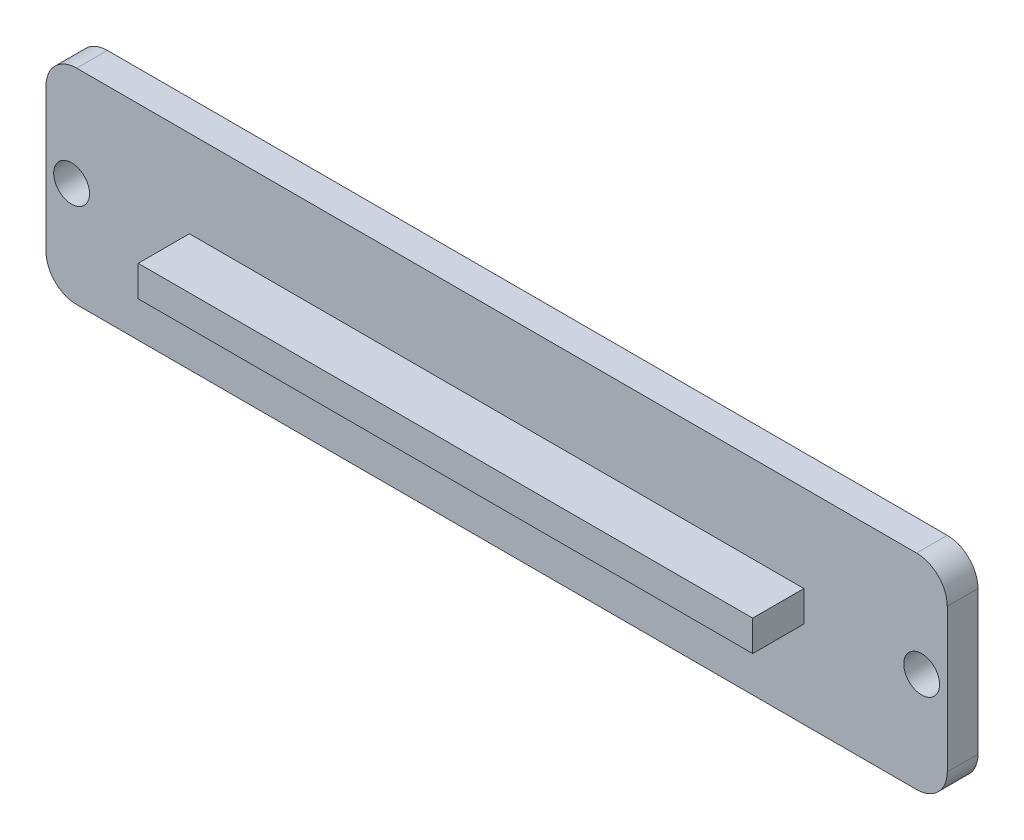
ISO-10303-21;
HEADER;
FILE_DESCRIPTION(('STEP AP214'),'2;1');
FILE_NAME('part.step','',(''),(''),'','','');
FILE_SCHEMA(('AUTOMOTIVE_DESIGN { 1 0 10303 214 1 1 1 1 }'));
ENDSEC;
DATA;
#1=APPLICATION_CONTEXT('core data for automotive mechanical design processes');
#2=APPLICATION_PROTOCOL_DEFINITION('international standard','automotive_design',2000,#1);
#3=PRODUCT_CONTEXT('',#1,'mechanical');
#4=PRODUCT('Part','Part','',(#3));
#5=PRODUCT_RELATED_PRODUCT_CATEGORY('part','',(#4));
#6=PRODUCT_DEFINITION_FORMATION('','',#4);
#7=PRODUCT_DEFINITION_CONTEXT('part definition',#1,'design');
#8=PRODUCT_DEFINITION('design','',#6,#7);
#9=PRODUCT_DEFINITION_SHAPE('','',#8);
#10=(LENGTH_UNIT() NAMED_UNIT(*) SI_UNIT(.MILLI.,.METRE.));
#11=(NAMED_UNIT(*) PLANE_ANGLE_UNIT() SI_UNIT($,.RADIAN.));
#12=(NAMED_UNIT(*) SI_UNIT($,.STERADIAN.) SOLID_ANGLE_UNIT());
#13=UNCERTAINTY_MEASURE_WITH_UNIT(LENGTH_MEASURE(1.E-05),#10,'distance_accuracy_value','');
#14=(GEOMETRIC_REPRESENTATION_CONTEXT(3) GLOBAL_UNCERTAINTY_ASSIGNED_CONTEXT((#13)) GLOBAL_UNIT_ASSIGNED_CONTEXT((#10,
#11,#12)) REPRESENTATION_CONTEXT('',''));
#15=CARTESIAN_POINT('',(0.,0.,0.));
#16=DIRECTION('',(0.,0.,1.));
#17=DIRECTION('',(1.,0.,0.));
#18=AXIS2_PLACEMENT_3D('',#15,#16,#17);
#19=CARTESIAN_POINT('',(0.,0.,3.));
#20=DIRECTION('',(0.,0.,-1.));
#21=DIRECTION('',(-1.,0.,0.));
#22=AXIS2_PLACEMENT_3D('',#19,#20,#21);
#23=PLANE('',#22);
#24=CARTESIAN_POINT('',(85.5,10.,3.));
#25=DIRECTION('',(0.,0.,1.));
#26=DIRECTION('',(1.,0.,0.));
#27=AXIS2_PLACEMENT_3D('',#24,#25,#26);
#28=CIRCLE('',#27,1.75);
#29=CARTESIAN_POINT('',(87.25,10.,3.));
#30=VERTEX_POINT('',#29);
#31=EDGE_CURVE('E152',#30,#30,#28,.T.);
#32=ORIENTED_EDGE('',*,*,#31,.F.);
#33=EDGE_LOOP('',(#32));
#34=FACE_BOUND('',#33,.T.);
#35=CARTESIAN_POINT('',(2.5,10.,3.));
#36=DIRECTION('',(0.,0.,1.));
#37=DIRECTION('',(1.,0.,0.));
#38=AXIS2_PLACEMENT_3D('',#35,#36,#37);
#39=CIRCLE('',#38,1.75);
#40=CARTESIAN_POINT('',(4.24999999999999,10.,3.));
#41=VERTEX_POINT('',#40);
#42=EDGE_CURVE('E161',#41,#41,#39,.T.);
#43=ORIENTED_EDGE('',*,*,#42,.F.);
#44=EDGE_LOOP('',(#43));
#45=FACE_BOUND('',#44,.T.);
#46=DIRECTION('',(1.,0.,0.));
#47=VECTOR('',#46,1.);
#48=CARTESIAN_POINT('',(0.,0.,3.));
#49=LINE('',#48,#47);
#50=CARTESIAN_POINT('',(3.,0.,3.));
#51=VERTEX_POINT('',#50);
#52=CARTESIAN_POINT('',(85.,0.,3.));
#53=VERTEX_POINT('',#52);
#54=EDGE_CURVE('E170',#51,#53,#49,.T.);
#55=ORIENTED_EDGE('',*,*,#54,.T.);
#56=CARTESIAN_POINT('',(85.,3.,3.));
#57=DIRECTION('',(0.,0.,-1.));
#58=DIRECTION('',(-1.,0.,0.));
#59=AXIS2_PLACEMENT_3D('',#56,#57,#58);
#60=CIRCLE('',#59,3.);
#61=CARTESIAN_POINT('',(88.,3.,3.));
#62=VERTEX_POINT('',#61);
#63=EDGE_CURVE('E210',#53,#62,#60,.F.);
#64=ORIENTED_EDGE('',*,*,#63,.T.);
#65=DIRECTION('',(0.,1.,0.));
#66=VECTOR('',#65,1.);
#67=CARTESIAN_POINT('',(88.,0.,3.));
#68=LINE('',#67,#66);
#69=CARTESIAN_POINT('',(88.,17.,3.));
#70=VERTEX_POINT('',#69);
#71=EDGE_CURVE('E174',#62,#70,#68,.T.);
#72=ORIENTED_EDGE('',*,*,#71,.T.);
#73=CARTESIAN_POINT('',(85.,17.,3.));
#74=DIRECTION('',(0.,0.,-1.));
#75=DIRECTION('',(-1.,0.,0.));
#76=AXIS2_PLACEMENT_3D('',#73,#74,#75);
#77=CIRCLE('',#76,3.);
#78=CARTESIAN_POINT('',(85.,20.,3.));
#79=VERTEX_POINT('',#78);
#80=EDGE_CURVE('E55',#70,#79,#77,.F.);
#81=ORIENTED_EDGE('',*,*,#80,.T.);
#82=DIRECTION('',(-1.,0.,0.));
#83=VECTOR('',#82,1.);
#84=CARTESIAN_POINT('',(0.,20.,3.));
#85=LINE('',#84,#83);
#86=CARTESIAN_POINT('',(3.,20.,3.));
#87=VERTEX_POINT('',#86);
#88=EDGE_CURVE('E176',#79,#87,#85,.T.);
#89=ORIENTED_EDGE('',*,*,#88,.T.);
#90=CARTESIAN_POINT('',(3.,17.,3.));
#91=DIRECTION('',(0.,0.,-1.));
#92=DIRECTION('',(-1.,0.,0.));
#93=AXIS2_PLACEMENT_3D('',#90,#91,#92);
#94=CIRCLE('',#93,3.);
#95=CARTESIAN_POINT('',(0.,17.,3.));
#96=VERTEX_POINT('',#95);
#97=EDGE_CURVE('E207',#87,#96,#94,.F.);
#98=ORIENTED_EDGE('',*,*,#97,.T.);
#99=DIRECTION('',(0.,-1.,0.));
#100=VECTOR('',#99,1.);
#101=CARTESIAN_POINT('',(0.,0.,3.));
#102=LINE('',#101,#100);
#103=CARTESIAN_POINT('',(0.,3.,3.));
#104=VERTEX_POINT('',#103);
#105=EDGE_CURVE('E167',#96,#104,#102,.T.);
#106=ORIENTED_EDGE('',*,*,#105,.T.);
#107=CARTESIAN_POINT('',(3.,3.,3.));
#108=DIRECTION('',(0.,0.,-1.));
#109=DIRECTION('',(-1.,0.,0.));
#110=AXIS2_PLACEMENT_3D('',#107,#108,#109);
#111=CIRCLE('',#110,3.);
#112=EDGE_CURVE('E205',#104,#51,#111,.F.);
#113=ORIENTED_EDGE('',*,*,#112,.T.);
#114=EDGE_LOOP('',(#55,#64,#72,#81,#89,#98,#106,#113));
#115=FACE_BOUND('',#114,.T.);
#116=DIRECTION('',(0.,-1.,0.));
#117=VECTOR('',#116,1.);
#118=CARTESIAN_POINT('',(14.,11.5,3.));
#119=LINE('',#118,#117);
#120=CARTESIAN_POINT('',(14.,11.5,3.));
#121=VERTEX_POINT('',#120);
#122=CARTESIAN_POINT('',(14.,8.5,3.));
#123=VERTEX_POINT('',#122);
#124=EDGE_CURVE('E148',#121,#123,#119,.T.);
#125=ORIENTED_EDGE('',*,*,#124,.F.);
#126=DIRECTION('',(-1.,0.,0.));
#127=VECTOR('',#126,1.);
#128=CARTESIAN_POINT('',(14.,11.5,3.));
#129=LINE('',#128,#127);
#130=CARTESIAN_POINT('',(74.,11.5,3.));
#131=VERTEX_POINT('',#130);
#132=EDGE_CURVE('E145',#131,#121,#129,.T.);
#133=ORIENTED_EDGE('',*,*,#132,.F.);
#134=DIRECTION('',(0.,1.,0.));
#135=VECTOR('',#134,1.);
#136=CARTESIAN_POINT('',(74.,11.5,3.));
#137=LINE('',#136,#135);
#138=CARTESIAN_POINT('',(74.,8.49999999999999,3.));
#139=VERTEX_POINT('',#138);
#140=EDGE_CURVE('E403',#139,#131,#137,.T.);
#141=ORIENTED_EDGE('',*,*,#140,.F.);
#142=DIRECTION('',(1.,0.,0.));
#143=VECTOR('',#142,1.);
#144=CARTESIAN_POINT('',(14.,8.5,3.));
#145=LINE('',#144,#143);
#146=EDGE_CURVE('E405',#123,#139,#145,.T.);
#147=ORIENTED_EDGE('',*,*,#146,.F.);
#148=EDGE_LOOP('',(#125,#133,#141,#147));
#149=FACE_BOUND('',#148,.T.);
#150=ADVANCED_FACE('F33',(#34,#45,#115,#149),#23,.F.);
#151=CARTESIAN_POINT('',(0.,0.,0.));
#152=DIRECTION('',(0.,0.,-1.));
#153=DIRECTION('',(-1.,0.,0.));
#154=AXIS2_PLACEMENT_3D('',#151,#152,#153);
#155=PLANE('',#154);
#156=CARTESIAN_POINT('',(2.5,10.,0.));
#157=DIRECTION('',(0.,0.,1.));
#158=DIRECTION('',(1.,0.,0.));
#159=AXIS2_PLACEMENT_3D('',#156,#157,#158);
#160=CIRCLE('',#159,1.75);
#161=CARTESIAN_POINT('',(4.24999999999999,10.,0.));
#162=VERTEX_POINT('',#161);
#163=EDGE_CURVE('E159',#162,#162,#160,.T.);
#164=ORIENTED_EDGE('',*,*,#163,.T.);
#165=EDGE_LOOP('',(#164));
#166=FACE_BOUND('',#165,.T.);
#167=DIRECTION('',(0.,1.,0.));
#168=VECTOR('',#167,1.);
#169=CARTESIAN_POINT('',(88.,0.,0.));
#170=LINE('',#169,#168);
#171=CARTESIAN_POINT('',(88.,3.,0.));
#172=VERTEX_POINT('',#171);
#173=CARTESIAN_POINT('',(88.,17.,0.));
#174=VERTEX_POINT('',#173);
#175=EDGE_CURVE('E184',#172,#174,#170,.T.);
#176=ORIENTED_EDGE('',*,*,#175,.F.);
#177=CARTESIAN_POINT('',(85.,3.,0.));
#178=DIRECTION('',(0.,0.,-1.));
#179=DIRECTION('',(-1.,0.,0.));
#180=AXIS2_PLACEMENT_3D('',#177,#178,#179);
#181=CIRCLE('',#180,3.);
#182=CARTESIAN_POINT('',(85.,0.,0.));
#183=VERTEX_POINT('',#182);
#184=EDGE_CURVE('E198',#172,#183,#181,.T.);
#185=ORIENTED_EDGE('',*,*,#184,.T.);
#186=DIRECTION('',(1.,0.,0.));
#187=VECTOR('',#186,1.);
#188=CARTESIAN_POINT('',(0.,0.,0.));
#189=LINE('',#188,#187);
#190=CARTESIAN_POINT('',(3.,0.,0.));
#191=VERTEX_POINT('',#190);
#192=EDGE_CURVE('E181',#191,#183,#189,.T.);
#193=ORIENTED_EDGE('',*,*,#192,.F.);
#194=CARTESIAN_POINT('',(3.,3.,0.));
#195=DIRECTION('',(0.,0.,-1.));
#196=DIRECTION('',(-1.,0.,0.));
#197=AXIS2_PLACEMENT_3D('',#194,#195,#196);
#198=CIRCLE('',#197,3.);
#199=CARTESIAN_POINT('',(0.,3.,0.));
#200=VERTEX_POINT('',#199);
#201=EDGE_CURVE('E192',#191,#200,#198,.T.);
#202=ORIENTED_EDGE('',*,*,#201,.T.);
#203=DIRECTION('',(0.,-1.,0.));
#204=VECTOR('',#203,1.);
#205=CARTESIAN_POINT('',(0.,0.,0.));
#206=LINE('',#205,#204);
#207=CARTESIAN_POINT('',(0.,17.,0.));
#208=VERTEX_POINT('',#207);
#209=EDGE_CURVE('E164',#208,#200,#206,.T.);
#210=ORIENTED_EDGE('',*,*,#209,.F.);
#211=CARTESIAN_POINT('',(3.,17.,0.));
#212=DIRECTION('',(0.,0.,-1.));
#213=DIRECTION('',(-1.,0.,0.));
#214=AXIS2_PLACEMENT_3D('',#211,#212,#213);
#215=CIRCLE('',#214,3.);
#216=CARTESIAN_POINT('',(3.,20.,0.));
#217=VERTEX_POINT('',#216);
#218=EDGE_CURVE('E194',#208,#217,#215,.T.);
#219=ORIENTED_EDGE('',*,*,#218,.T.);
#220=DIRECTION('',(-1.,0.,0.));
#221=VECTOR('',#220,1.);
#222=CARTESIAN_POINT('',(0.,20.,0.));
#223=LINE('',#222,#221);
#224=CARTESIAN_POINT('',(85.,20.,0.));
#225=VERTEX_POINT('',#224);
#226=EDGE_CURVE('E171',#225,#217,#223,.T.);
#227=ORIENTED_EDGE('',*,*,#226,.F.);
#228=CARTESIAN_POINT('',(85.,17.,0.));
#229=DIRECTION('',(0.,0.,-1.));
#230=DIRECTION('',(-1.,0.,0.));
#231=AXIS2_PLACEMENT_3D('',#228,#229,#230);
#232=CIRCLE('',#231,3.);
#233=EDGE_CURVE('E196',#225,#174,#232,.T.);
#234=ORIENTED_EDGE('',*,*,#233,.T.);
#235=EDGE_LOOP('',(#176,#185,#193,#202,#210,#219,#227,#234));
#236=FACE_BOUND('',#235,.T.);
#237=CARTESIAN_POINT('',(85.5,10.,0.));
#238=DIRECTION('',(0.,0.,1.));
#239=DIRECTION('',(1.,0.,0.));
#240=AXIS2_PLACEMENT_3D('',#237,#238,#239);
#241=CIRCLE('',#240,1.75);
#242=CARTESIAN_POINT('',(87.25,10.,0.));
#243=VERTEX_POINT('',#242);
#244=EDGE_CURVE('E149',#243,#243,#241,.T.);
#245=ORIENTED_EDGE('',*,*,#244,.T.);
#246=EDGE_LOOP('',(#245));
#247=FACE_BOUND('',#246,.T.);
#248=ADVANCED_FACE('F233',(#166,#236,#247),#155,.T.);
#249=CARTESIAN_POINT('',(0.,0.,3.));
#250=DIRECTION('',(1.,0.,0.));
#251=DIRECTION('',(0.,0.,-1.));
#252=AXIS2_PLACEMENT_3D('',#249,#250,#251);
#253=PLANE('',#252);
#254=ORIENTED_EDGE('',*,*,#105,.F.);
#255=DIRECTION('',(0.,0.,-1.));
#256=VECTOR('',#255,1.);
#257=CARTESIAN_POINT('',(0.,17.,3.));
#258=LINE('',#257,#256);
#259=EDGE_CURVE('E11',#96,#208,#258,.T.);
#260=ORIENTED_EDGE('',*,*,#259,.T.);
#261=ORIENTED_EDGE('',*,*,#209,.T.);
#262=DIRECTION('',(0.,0.,-1.));
#263=VECTOR('',#262,1.);
#264=CARTESIAN_POINT('',(0.,3.,3.));
#265=LINE('',#264,#263);
#266=EDGE_CURVE('E41',#200,#104,#265,.F.);
#267=ORIENTED_EDGE('',*,*,#266,.T.);
#268=EDGE_LOOP('',(#254,#260,#261,#267));
#269=FACE_BOUND('',#268,.T.);
#270=ADVANCED_FACE('F218',(#269),#253,.F.);
#271=CARTESIAN_POINT('',(0.,0.,3.));
#272=DIRECTION('',(0.,1.,0.));
#273=DIRECTION('',(0.,0.,1.));
#274=AXIS2_PLACEMENT_3D('',#271,#272,#273);
#275=PLANE('',#274);
#276=ORIENTED_EDGE('',*,*,#192,.T.);
#277=DIRECTION('',(0.,0.,-1.));
#278=VECTOR('',#277,1.);
#279=CARTESIAN_POINT('',(85.,0.,3.));
#280=LINE('',#279,#278);
#281=EDGE_CURVE('E203',#183,#53,#280,.F.);
#282=ORIENTED_EDGE('',*,*,#281,.T.);
#283=ORIENTED_EDGE('',*,*,#54,.F.);
#284=DIRECTION('',(0.,0.,-1.));
#285=VECTOR('',#284,1.);
#286=CARTESIAN_POINT('',(3.,0.,3.));
#287=LINE('',#286,#285);
#288=EDGE_CURVE('E200',#51,#191,#287,.T.);
#289=ORIENTED_EDGE('',*,*,#288,.T.);
#290=EDGE_LOOP('',(#276,#282,#283,#289));
#291=FACE_BOUND('',#290,.T.);
#292=ADVANCED_FACE('F229',(#291),#275,.F.);
#293=CARTESIAN_POINT('',(88.,0.,3.));
#294=DIRECTION('',(-1.,0.,0.));
#295=DIRECTION('',(0.,0.,1.));
#296=AXIS2_PLACEMENT_3D('',#293,#294,#295);
#297=PLANE('',#296);
#298=ORIENTED_EDGE('',*,*,#71,.F.);
#299=DIRECTION('',(0.,0.,-1.));
#300=VECTOR('',#299,1.);
#301=CARTESIAN_POINT('',(88.,3.,3.));
#302=LINE('',#301,#300);
#303=EDGE_CURVE('E189',#62,#172,#302,.T.);
#304=ORIENTED_EDGE('',*,*,#303,.T.);
#305=ORIENTED_EDGE('',*,*,#175,.T.);
#306=DIRECTION('',(0.,0.,-1.));
#307=VECTOR('',#306,1.);
#308=CARTESIAN_POINT('',(88.,17.,3.));
#309=LINE('',#308,#307);
#310=EDGE_CURVE('E178',#174,#70,#309,.F.);
#311=ORIENTED_EDGE('',*,*,#310,.T.);
#312=EDGE_LOOP('',(#298,#304,#305,#311));
#313=FACE_BOUND('',#312,.T.);
#314=ADVANCED_FACE('F241',(#313),#297,.F.);
#315=CARTESIAN_POINT('',(0.,20.,3.));
#316=DIRECTION('',(0.,-1.,0.));
#317=DIRECTION('',(0.,0.,-1.));
#318=AXIS2_PLACEMENT_3D('',#315,#316,#317);
#319=PLANE('',#318);
#320=ORIENTED_EDGE('',*,*,#88,.F.);
#321=DIRECTION('',(0.,0.,-1.));
#322=VECTOR('',#321,1.);
#323=CARTESIAN_POINT('',(85.,20.,3.));
#324=LINE('',#323,#322);
#325=EDGE_CURVE('E213',#79,#225,#324,.T.);
#326=ORIENTED_EDGE('',*,*,#325,.T.);
#327=ORIENTED_EDGE('',*,*,#226,.T.);
#328=DIRECTION('',(0.,0.,-1.));
#329=VECTOR('',#328,1.);
#330=CARTESIAN_POINT('',(3.,20.,3.));
#331=LINE('',#330,#329);
#332=EDGE_CURVE('E48',#217,#87,#331,.F.);
#333=ORIENTED_EDGE('',*,*,#332,.T.);
#334=EDGE_LOOP('',(#320,#326,#327,#333));
#335=FACE_BOUND('',#334,.T.);
#336=ADVANCED_FACE('F247',(#335),#319,.F.);
#337=CARTESIAN_POINT('',(2.5,10.,3.));
#338=DIRECTION('',(0.,0.,-1.));
#339=DIRECTION('',(-1.,0.,0.));
#340=AXIS2_PLACEMENT_3D('',#337,#338,#339);
#341=CYLINDRICAL_SURFACE('',#340,1.75);
#342=ORIENTED_EDGE('',*,*,#42,.T.);
#343=EDGE_LOOP('',(#342));
#344=FACE_BOUND('',#343,.T.);
#345=ORIENTED_EDGE('',*,*,#163,.F.);
#346=EDGE_LOOP('',(#345));
#347=FACE_BOUND('',#346,.T.);
#348=ADVANCED_FACE('F268',(#344,#347),#341,.F.);
#349=CARTESIAN_POINT('',(85.5,10.,3.));
#350=DIRECTION('',(0.,0.,-1.));
#351=DIRECTION('',(-1.,0.,0.));
#352=AXIS2_PLACEMENT_3D('',#349,#350,#351);
#353=CYLINDRICAL_SURFACE('',#352,1.75);
#354=ORIENTED_EDGE('',*,*,#31,.T.);
#355=EDGE_LOOP('',(#354));
#356=FACE_BOUND('',#355,.T.);
#357=ORIENTED_EDGE('',*,*,#244,.F.);
#358=EDGE_LOOP('',(#357));
#359=FACE_BOUND('',#358,.T.);
#360=ADVANCED_FACE('F297',(#356,#359),#353,.F.);
#361=CARTESIAN_POINT('',(14.,11.5,8.));
#362=DIRECTION('',(1.,0.,0.));
#363=DIRECTION('',(0.,0.,-1.));
#364=AXIS2_PLACEMENT_3D('',#361,#362,#363);
#365=PLANE('',#364);
#366=ORIENTED_EDGE('',*,*,#124,.T.);
#367=DIRECTION('',(0.,0.,-1.));
#368=VECTOR('',#367,1.);
#369=CARTESIAN_POINT('',(14.,8.5,8.));
#370=LINE('',#369,#368);
#371=CARTESIAN_POINT('',(14.,8.5,8.));
#372=VERTEX_POINT('',#371);
#373=EDGE_CURVE('E129',#372,#123,#370,.T.);
#374=ORIENTED_EDGE('',*,*,#373,.F.);
#375=DIRECTION('',(0.,-1.,0.));
#376=VECTOR('',#375,1.);
#377=CARTESIAN_POINT('',(14.,11.5,8.));
#378=LINE('',#377,#376);
#379=CARTESIAN_POINT('',(14.,11.5,8.));
#380=VERTEX_POINT('',#379);
#381=EDGE_CURVE('E136',#380,#372,#378,.T.);
#382=ORIENTED_EDGE('',*,*,#381,.F.);
#383=DIRECTION('',(0.,0.,-1.));
#384=VECTOR('',#383,1.);
#385=CARTESIAN_POINT('',(14.,11.5,8.));
#386=LINE('',#385,#384);
#387=EDGE_CURVE('E408',#380,#121,#386,.T.);
#388=ORIENTED_EDGE('',*,*,#387,.T.);
#389=EDGE_LOOP('',(#366,#374,#382,#388));
#390=FACE_BOUND('',#389,.T.);
#391=ADVANCED_FACE('F147',(#390),#365,.F.);
#392=CARTESIAN_POINT('',(14.,8.5,8.));
#393=DIRECTION('',(0.,1.,0.));
#394=DIRECTION('',(-1.,0.,0.));
#395=AXIS2_PLACEMENT_3D('',#392,#393,#394);
#396=PLANE('',#395);
#397=ORIENTED_EDGE('',*,*,#146,.T.);
#398=DIRECTION('',(0.,0.,-1.));
#399=VECTOR('',#398,1.);
#400=CARTESIAN_POINT('',(74.,8.49999999999999,8.));
#401=LINE('',#400,#399);
#402=CARTESIAN_POINT('',(74.,8.49999999999999,8.));
#403=VERTEX_POINT('',#402);
#404=EDGE_CURVE('E132',#403,#139,#401,.T.);
#405=ORIENTED_EDGE('',*,*,#404,.F.);
#406=DIRECTION('',(1.,0.,0.));
#407=VECTOR('',#406,1.);
#408=CARTESIAN_POINT('',(14.,8.5,8.));
#409=LINE('',#408,#407);
#410=EDGE_CURVE('E124',#372,#403,#409,.T.);
#411=ORIENTED_EDGE('',*,*,#410,.F.);
#412=ORIENTED_EDGE('',*,*,#373,.T.);
#413=EDGE_LOOP('',(#397,#405,#411,#412));
#414=FACE_BOUND('',#413,.T.);
#415=ADVANCED_FACE('F127',(#414),#396,.F.);
#416=CARTESIAN_POINT('',(74.,11.5,8.));
#417=DIRECTION('',(-1.,0.,0.));
#418=DIRECTION('',(0.,0.,1.));
#419=AXIS2_PLACEMENT_3D('',#416,#417,#418);
#420=PLANE('',#419);
#421=ORIENTED_EDGE('',*,*,#140,.T.);
#422=DIRECTION('',(0.,0.,-1.));
#423=VECTOR('',#422,1.);
#424=CARTESIAN_POINT('',(74.,11.5,8.));
#425=LINE('',#424,#423);
#426=CARTESIAN_POINT('',(74.,11.5,8.));
#427=VERTEX_POINT('',#426);
#428=EDGE_CURVE('E154',#427,#131,#425,.T.);
#429=ORIENTED_EDGE('',*,*,#428,.F.);
#430=DIRECTION('',(0.,1.,0.));
#431=VECTOR('',#430,1.);
#432=CARTESIAN_POINT('',(74.,11.5,8.));
#433=LINE('',#432,#431);
#434=EDGE_CURVE('E135',#403,#427,#433,.T.);
#435=ORIENTED_EDGE('',*,*,#434,.F.);
#436=ORIENTED_EDGE('',*,*,#404,.T.);
#437=EDGE_LOOP('',(#421,#429,#435,#436));
#438=FACE_BOUND('',#437,.T.);
#439=ADVANCED_FACE('F287',(#438),#420,.F.);
#440=CARTESIAN_POINT('',(14.,11.5,8.));
#441=DIRECTION('',(0.,-1.,0.));
#442=DIRECTION('',(1.,0.,0.));
#443=AXIS2_PLACEMENT_3D('',#440,#441,#442);
#444=PLANE('',#443);
#445=ORIENTED_EDGE('',*,*,#132,.T.);
#446=ORIENTED_EDGE('',*,*,#387,.F.);
#447=DIRECTION('',(-1.,0.,0.));
#448=VECTOR('',#447,1.);
#449=CARTESIAN_POINT('',(14.,11.5,8.));
#450=LINE('',#449,#448);
#451=EDGE_CURVE('E141',#427,#380,#450,.T.);
#452=ORIENTED_EDGE('',*,*,#451,.F.);
#453=ORIENTED_EDGE('',*,*,#428,.T.);
#454=EDGE_LOOP('',(#445,#446,#452,#453));
#455=FACE_BOUND('',#454,.T.);
#456=ADVANCED_FACE('F283',(#455),#444,.F.);
#457=CARTESIAN_POINT('',(0.,0.,8.));
#458=DIRECTION('',(0.,0.,1.));
#459=DIRECTION('',(1.,0.,0.));
#460=AXIS2_PLACEMENT_3D('',#457,#458,#459);
#461=PLANE('',#460);
#462=ORIENTED_EDGE('',*,*,#381,.T.);
#463=ORIENTED_EDGE('',*,*,#410,.T.);
#464=ORIENTED_EDGE('',*,*,#434,.T.);
#465=ORIENTED_EDGE('',*,*,#451,.T.);
#466=EDGE_LOOP('',(#462,#463,#464,#465));
#467=FACE_BOUND('',#466,.T.);
#468=ADVANCED_FACE('F139',(#467),#461,.T.);
#469=CARTESIAN_POINT('',(85.,3.,3.));
#470=DIRECTION('',(0.,0.,-1.));
#471=DIRECTION('',(-1.,0.,0.));
#472=AXIS2_PLACEMENT_3D('',#469,#470,#471);
#473=CYLINDRICAL_SURFACE('',#472,3.);
#474=ORIENTED_EDGE('',*,*,#63,.F.);
#475=ORIENTED_EDGE('',*,*,#281,.F.);
#476=ORIENTED_EDGE('',*,*,#184,.F.);
#477=ORIENTED_EDGE('',*,*,#303,.F.);
#478=EDGE_LOOP('',(#474,#475,#476,#477));
#479=FACE_BOUND('',#478,.T.);
#480=ADVANCED_FACE('F238',(#479),#473,.T.);
#481=CARTESIAN_POINT('',(85.,17.,3.));
#482=DIRECTION('',(0.,0.,-1.));
#483=DIRECTION('',(-1.,0.,0.));
#484=AXIS2_PLACEMENT_3D('',#481,#482,#483);
#485=CYLINDRICAL_SURFACE('',#484,3.);
#486=ORIENTED_EDGE('',*,*,#80,.F.);
#487=ORIENTED_EDGE('',*,*,#310,.F.);
#488=ORIENTED_EDGE('',*,*,#233,.F.);
#489=ORIENTED_EDGE('',*,*,#325,.F.);
#490=EDGE_LOOP('',(#486,#487,#488,#489));
#491=FACE_BOUND('',#490,.T.);
#492=ADVANCED_FACE('F245',(#491),#485,.T.);
#493=CARTESIAN_POINT('',(3.,17.,3.));
#494=DIRECTION('',(0.,0.,-1.));
#495=DIRECTION('',(-1.,0.,0.));
#496=AXIS2_PLACEMENT_3D('',#493,#494,#495);
#497=CYLINDRICAL_SURFACE('',#496,3.);
#498=ORIENTED_EDGE('',*,*,#97,.F.);
#499=ORIENTED_EDGE('',*,*,#332,.F.);
#500=ORIENTED_EDGE('',*,*,#218,.F.);
#501=ORIENTED_EDGE('',*,*,#259,.F.);
#502=EDGE_LOOP('',(#498,#499,#500,#501));
#503=FACE_BOUND('',#502,.T.);
#504=ADVANCED_FACE('F249',(#503),#497,.T.);
#505=CARTESIAN_POINT('',(3.,3.,3.));
#506=DIRECTION('',(0.,0.,-1.));
#507=DIRECTION('',(-1.,0.,0.));
#508=AXIS2_PLACEMENT_3D('',#505,#506,#507);
#509=CYLINDRICAL_SURFACE('',#508,3.);
#510=ORIENTED_EDGE('',*,*,#112,.F.);
#511=ORIENTED_EDGE('',*,*,#266,.F.);
#512=ORIENTED_EDGE('',*,*,#201,.F.);
#513=ORIENTED_EDGE('',*,*,#288,.F.);
#514=EDGE_LOOP('',(#510,#511,#512,#513));
#515=FACE_BOUND('',#514,.T.);
#516=ADVANCED_FACE('F35',(#515),#509,.T.);
#517=CLOSED_SHELL('',(#150,#248,#270,#292,#314,#336,#348,#360,#391,#415,#439,#456,#468,#480,
#492,#504,#516));
#518=MANIFOLD_SOLID_BREP('B2',#517);
#519=ADVANCED_BREP_SHAPE_REPRESENTATION('',(#18,#518),#14);
#520=SHAPE_DEFINITION_REPRESENTATION(#9,#519);
ENDSEC;
END-ISO-10303-21;
